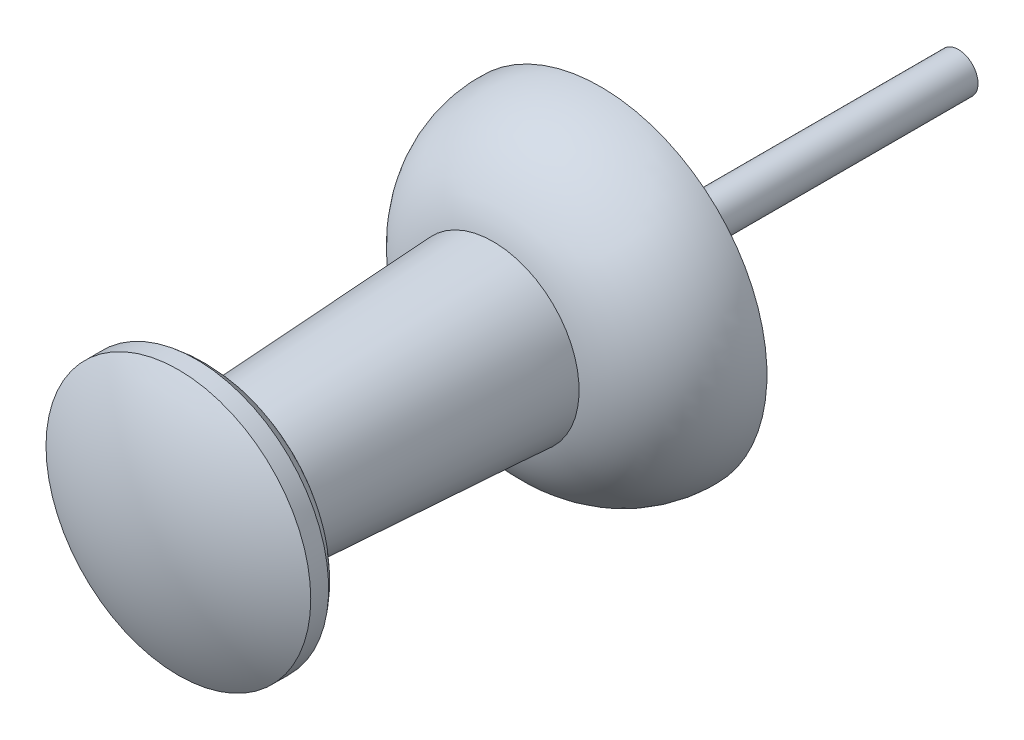
ISO-10303-21;
HEADER;
FILE_DESCRIPTION(('STEP AP214'),'2;1');
FILE_NAME('part.step','',(''),(''),'','','');
FILE_SCHEMA(('AUTOMOTIVE_DESIGN { 1 0 10303 214 1 1 1 1 }'));
ENDSEC;
DATA;
#1=APPLICATION_CONTEXT('core data for automotive mechanical design processes');
#2=APPLICATION_PROTOCOL_DEFINITION('international standard','automotive_design',2000,#1);
#3=PRODUCT_CONTEXT('',#1,'mechanical');
#4=PRODUCT('Part','Part','',(#3));
#5=PRODUCT_RELATED_PRODUCT_CATEGORY('part','',(#4));
#6=PRODUCT_DEFINITION_FORMATION('','',#4);
#7=PRODUCT_DEFINITION_CONTEXT('part definition',#1,'design');
#8=PRODUCT_DEFINITION('design','',#6,#7);
#9=PRODUCT_DEFINITION_SHAPE('','',#8);
#10=(LENGTH_UNIT() NAMED_UNIT(*) SI_UNIT(.MILLI.,.METRE.));
#11=(NAMED_UNIT(*) PLANE_ANGLE_UNIT() SI_UNIT($,.RADIAN.));
#12=(NAMED_UNIT(*) SI_UNIT($,.STERADIAN.) SOLID_ANGLE_UNIT());
#13=UNCERTAINTY_MEASURE_WITH_UNIT(LENGTH_MEASURE(1.E-05),#10,'distance_accuracy_value','');
#14=(GEOMETRIC_REPRESENTATION_CONTEXT(3) GLOBAL_UNCERTAINTY_ASSIGNED_CONTEXT((#13)) GLOBAL_UNIT_ASSIGNED_CONTEXT((#10,
#11,#12)) REPRESENTATION_CONTEXT('',''));
#15=CARTESIAN_POINT('',(0.,0.,0.));
#16=DIRECTION('',(0.,0.,1.));
#17=DIRECTION('',(1.,0.,0.));
#18=AXIS2_PLACEMENT_3D('',#15,#16,#17);
#19=CARTESIAN_POINT('',(0.,0.55,-10.));
#20=DIRECTION('',(0.,0.,-1.));
#21=DIRECTION('',(-1.,0.,0.));
#22=AXIS2_PLACEMENT_3D('',#19,#20,#21);
#23=PLANE('',#22);
#24=CARTESIAN_POINT('',(0.,0.,-9.99999999999999));
#25=DIRECTION('',(0.,0.,-1.));
#26=DIRECTION('',(-1.,0.,0.));
#27=AXIS2_PLACEMENT_3D('',#24,#25,#26);
#28=CIRCLE('',#27,0.55);
#29=CARTESIAN_POINT('',(-0.55,0.,-9.99999999999999));
#30=VERTEX_POINT('',#29);
#31=EDGE_CURVE('E56',#30,#30,#28,.T.);
#32=ORIENTED_EDGE('',*,*,#31,.T.);
#33=EDGE_LOOP('',(#32));
#34=FACE_BOUND('',#33,.T.);
#35=ADVANCED_FACE('F31',(#34),#23,.T.);
#36=CARTESIAN_POINT('',(0.,0.,5.45499999999999));
#37=DIRECTION('',(0.,0.,-1.));
#38=DIRECTION('',(0.,1.,0.));
#39=AXIS2_PLACEMENT_3D('',#36,#37,#38);
#40=SPHERICAL_SURFACE('',#39,7.34500000000001);
#41=CARTESIAN_POINT('',(0.,0.,11.8));
#42=DIRECTION('',(0.,0.,-1.));
#43=DIRECTION('',(-1.,0.,0.));
#44=AXIS2_PLACEMENT_3D('',#41,#42,#43);
#45=CIRCLE('',#44,3.7);
#46=CARTESIAN_POINT('',(-3.7,0.,11.8));
#47=VERTEX_POINT('',#46);
#48=EDGE_CURVE('E10',#47,#47,#45,.T.);
#49=ORIENTED_EDGE('',*,*,#48,.F.);
#50=EDGE_LOOP('',(#49));
#51=FACE_BOUND('',#50,.T.);
#52=ADVANCED_FACE('F73',(#51),#40,.T.);
#53=CARTESIAN_POINT('',(0.,0.,-88.99));
#54=DIRECTION('',(0.,0.,-1.));
#55=DIRECTION('',(-1.,0.,0.));
#56=AXIS2_PLACEMENT_3D('',#53,#54,#55);
#57=CYLINDRICAL_SURFACE('',#56,3.7);
#58=ORIENTED_EDGE('',*,*,#48,.T.);
#59=EDGE_LOOP('',(#58));
#60=FACE_BOUND('',#59,.T.);
#61=CARTESIAN_POINT('',(0.,0.,11.3));
#62=DIRECTION('',(0.,0.,-1.));
#63=DIRECTION('',(-1.,0.,0.));
#64=AXIS2_PLACEMENT_3D('',#61,#62,#63);
#65=CIRCLE('',#64,3.7);
#66=CARTESIAN_POINT('',(-3.7,0.,11.3));
#67=VERTEX_POINT('',#66);
#68=EDGE_CURVE('E37',#67,#67,#65,.T.);
#69=ORIENTED_EDGE('',*,*,#68,.F.);
#70=EDGE_LOOP('',(#69));
#71=FACE_BOUND('',#70,.T.);
#72=ADVANCED_FACE('F77',(#60,#71),#57,.T.);
#73=CARTESIAN_POINT('',(0.,0.,12.4975880368264));
#74=DIRECTION('',(0.,0.,-1.));
#75=DIRECTION('',(-1.,0.,0.));
#76=AXIS2_PLACEMENT_3D('',#73,#74,#75);
#77=TOROIDAL_SURFACE('',#76,2.09819386502288,2.);
#78=ORIENTED_EDGE('',*,*,#68,.T.);
#79=EDGE_LOOP('',(#78));
#80=FACE_BOUND('',#79,.T.);
#81=CARTESIAN_POINT('',(0.,0.,10.5));
#82=DIRECTION('',(0.,0.,-1.));
#83=DIRECTION('',(-1.,0.,0.));
#84=AXIS2_PLACEMENT_3D('',#81,#82,#83);
#85=CIRCLE('',#84,2.);
#86=CARTESIAN_POINT('',(-2.,0.,10.5));
#87=VERTEX_POINT('',#86);
#88=EDGE_CURVE('E41',#87,#87,#85,.T.);
#89=ORIENTED_EDGE('',*,*,#88,.F.);
#90=EDGE_LOOP('',(#89));
#91=FACE_BOUND('',#90,.T.);
#92=ADVANCED_FACE('F82',(#80,#91),#77,.T.);
#93=CARTESIAN_POINT('',(0.,0.,3.));
#94=DIRECTION('',(0.,0.,-1.));
#95=DIRECTION('',(-1.,0.,0.));
#96=AXIS2_PLACEMENT_3D('',#93,#94,#95);
#97=CONICAL_SURFACE('',#96,2.4,0.0532828515596924);
#98=ORIENTED_EDGE('',*,*,#88,.T.);
#99=EDGE_LOOP('',(#98));
#100=FACE_BOUND('',#99,.T.);
#101=CARTESIAN_POINT('',(0.,0.,3.));
#102=DIRECTION('',(0.,0.,-1.));
#103=DIRECTION('',(-1.,0.,0.));
#104=AXIS2_PLACEMENT_3D('',#101,#102,#103);
#105=CIRCLE('',#104,2.4);
#106=CARTESIAN_POINT('',(-2.4,0.,3.));
#107=VERTEX_POINT('',#106);
#108=EDGE_CURVE('E45',#107,#107,#105,.T.);
#109=ORIENTED_EDGE('',*,*,#108,.F.);
#110=EDGE_LOOP('',(#109));
#111=FACE_BOUND('',#110,.T.);
#112=ADVANCED_FACE('F87',(#100,#111),#97,.T.);
#113=CARTESIAN_POINT('',(0.,0.,0.0948754503603605));
#114=DIRECTION('',(0.,0.,-1.));
#115=DIRECTION('',(-1.,0.,0.));
#116=AXIS2_PLACEMENT_3D('',#113,#114,#115);
#117=DEGENERATE_TOROIDAL_SURFACE('',#116,1.65150060048048,3.,.T.);
#118=ORIENTED_EDGE('',*,*,#108,.T.);
#119=EDGE_LOOP('',(#118));
#120=FACE_BOUND('',#119,.T.);
#121=CARTESIAN_POINT('',(0.,0.,0.));
#122=DIRECTION('',(0.,0.,-1.));
#123=DIRECTION('',(-1.,0.,0.));
#124=AXIS2_PLACEMENT_3D('',#121,#122,#123);
#125=CIRCLE('',#124,4.65);
#126=CARTESIAN_POINT('',(-4.65,0.,0.));
#127=VERTEX_POINT('',#126);
#128=EDGE_CURVE('E50',#127,#127,#125,.T.);
#129=ORIENTED_EDGE('',*,*,#128,.F.);
#130=EDGE_LOOP('',(#129));
#131=FACE_BOUND('',#130,.T.);
#132=ADVANCED_FACE('F69',(#120,#131),#117,.T.);
#133=CARTESIAN_POINT('',(0.,0.549999999999999,0.));
#134=DIRECTION('',(0.,0.,-1.));
#135=DIRECTION('',(-1.,0.,0.));
#136=AXIS2_PLACEMENT_3D('',#133,#134,#135);
#137=PLANE('',#136);
#138=ORIENTED_EDGE('',*,*,#128,.T.);
#139=EDGE_LOOP('',(#138));
#140=FACE_BOUND('',#139,.T.);
#141=CARTESIAN_POINT('',(0.,0.,0.));
#142=DIRECTION('',(0.,0.,-1.));
#143=DIRECTION('',(-1.,0.,0.));
#144=AXIS2_PLACEMENT_3D('',#141,#142,#143);
#145=CIRCLE('',#144,0.549999999999999);
#146=CARTESIAN_POINT('',(-0.549999999999999,0.,0.));
#147=VERTEX_POINT('',#146);
#148=EDGE_CURVE('E53',#147,#147,#145,.T.);
#149=ORIENTED_EDGE('',*,*,#148,.F.);
#150=EDGE_LOOP('',(#149));
#151=FACE_BOUND('',#150,.T.);
#152=ADVANCED_FACE('F63',(#140,#151),#137,.T.);
#153=CARTESIAN_POINT('',(0.,0.,-88.99));
#154=DIRECTION('',(0.,0.,-1.));
#155=DIRECTION('',(-1.,0.,0.));
#156=AXIS2_PLACEMENT_3D('',#153,#154,#155);
#157=CYLINDRICAL_SURFACE('',#156,0.549999999999999);
#158=ORIENTED_EDGE('',*,*,#148,.T.);
#159=EDGE_LOOP('',(#158));
#160=FACE_BOUND('',#159,.T.);
#161=ORIENTED_EDGE('',*,*,#31,.F.);
#162=EDGE_LOOP('',(#161));
#163=FACE_BOUND('',#162,.T.);
#164=ADVANCED_FACE('F61',(#160,#163),#157,.T.);
#165=CLOSED_SHELL('',(#35,#52,#72,#92,#112,#132,#152,#164));
#166=MANIFOLD_SOLID_BREP('B2',#165);
#167=ADVANCED_BREP_SHAPE_REPRESENTATION('',(#18,#166),#14);
#168=SHAPE_DEFINITION_REPRESENTATION(#9,#167);
ENDSEC;
END-ISO-10303-21;
